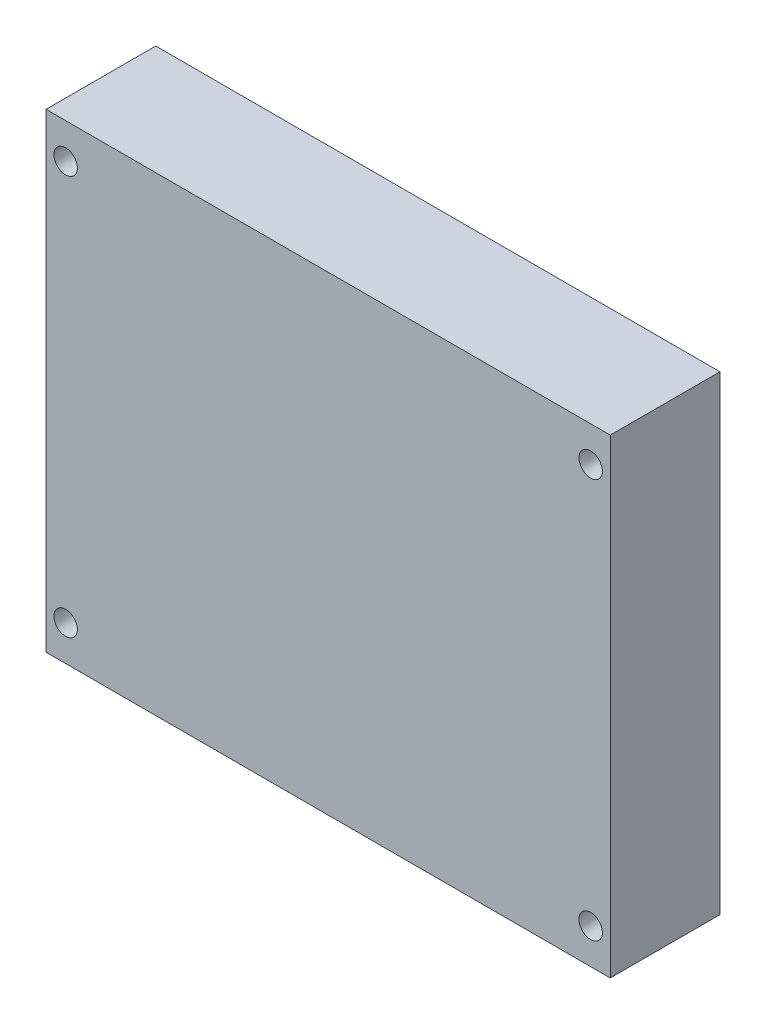
ISO-10303-21;
HEADER;
FILE_DESCRIPTION(('STEP AP214'),'2;1');
FILE_NAME('part.step','',(''),(''),'','','');
FILE_SCHEMA(('AUTOMOTIVE_DESIGN { 1 0 10303 214 1 1 1 1 }'));
ENDSEC;
DATA;
#1=APPLICATION_CONTEXT('core data for automotive mechanical design processes');
#2=APPLICATION_PROTOCOL_DEFINITION('international standard','automotive_design',2000,#1);
#3=PRODUCT_CONTEXT('',#1,'mechanical');
#4=PRODUCT('Part','Part','',(#3));
#5=PRODUCT_RELATED_PRODUCT_CATEGORY('part','',(#4));
#6=PRODUCT_DEFINITION_FORMATION('','',#4);
#7=PRODUCT_DEFINITION_CONTEXT('part definition',#1,'design');
#8=PRODUCT_DEFINITION('design','',#6,#7);
#9=PRODUCT_DEFINITION_SHAPE('','',#8);
#10=(LENGTH_UNIT() NAMED_UNIT(*) SI_UNIT(.MILLI.,.METRE.));
#11=(NAMED_UNIT(*) PLANE_ANGLE_UNIT() SI_UNIT($,.RADIAN.));
#12=(NAMED_UNIT(*) SI_UNIT($,.STERADIAN.) SOLID_ANGLE_UNIT());
#13=UNCERTAINTY_MEASURE_WITH_UNIT(LENGTH_MEASURE(1.E-05),#10,'distance_accuracy_value','');
#14=(GEOMETRIC_REPRESENTATION_CONTEXT(3) GLOBAL_UNCERTAINTY_ASSIGNED_CONTEXT((#13)) GLOBAL_UNIT_ASSIGNED_CONTEXT((#10,
#11,#12)) REPRESENTATION_CONTEXT('',''));
#15=CARTESIAN_POINT('',(0.,0.,0.));
#16=DIRECTION('',(0.,0.,1.));
#17=DIRECTION('',(1.,0.,0.));
#18=AXIS2_PLACEMENT_3D('',#15,#16,#17);
#19=CARTESIAN_POINT('',(0.,0.,14.));
#20=DIRECTION('',(0.,0.,-1.));
#21=DIRECTION('',(-1.,0.,0.));
#22=AXIS2_PLACEMENT_3D('',#19,#20,#21);
#23=PLANE('',#22);
#24=DIRECTION('',(0.,-1.,0.));
#25=VECTOR('',#24,1.);
#26=CARTESIAN_POINT('',(0.,0.,14.));
#27=LINE('',#26,#25);
#28=CARTESIAN_POINT('',(0.,60.,14.));
#29=VERTEX_POINT('',#28);
#30=CARTESIAN_POINT('',(0.,0.,14.));
#31=VERTEX_POINT('',#30);
#32=EDGE_CURVE('E84',#29,#31,#27,.T.);
#33=ORIENTED_EDGE('',*,*,#32,.T.);
#34=DIRECTION('',(1.,0.,0.));
#35=VECTOR('',#34,1.);
#36=CARTESIAN_POINT('',(0.,0.,14.));
#37=LINE('',#36,#35);
#38=CARTESIAN_POINT('',(72.,0.,14.));
#39=VERTEX_POINT('',#38);
#40=EDGE_CURVE('E79',#31,#39,#37,.T.);
#41=ORIENTED_EDGE('',*,*,#40,.T.);
#42=DIRECTION('',(0.,1.,0.));
#43=VECTOR('',#42,1.);
#44=CARTESIAN_POINT('',(72.,0.,14.));
#45=LINE('',#44,#43);
#46=CARTESIAN_POINT('',(72.,60.,14.));
#47=VERTEX_POINT('',#46);
#48=EDGE_CURVE('E82',#39,#47,#45,.T.);
#49=ORIENTED_EDGE('',*,*,#48,.T.);
#50=DIRECTION('',(-1.,0.,0.));
#51=VECTOR('',#50,1.);
#52=CARTESIAN_POINT('',(0.,60.,14.));
#53=LINE('',#52,#51);
#54=EDGE_CURVE('E49',#47,#29,#53,.T.);
#55=ORIENTED_EDGE('',*,*,#54,.T.);
#56=EDGE_LOOP('',(#33,#41,#49,#55));
#57=FACE_BOUND('',#56,.T.);
#58=CARTESIAN_POINT('',(2.5,55.5,14.));
#59=DIRECTION('',(0.,0.,1.));
#60=DIRECTION('',(1.,0.,0.));
#61=AXIS2_PLACEMENT_3D('',#58,#59,#60);
#62=CIRCLE('',#61,1.5);
#63=CARTESIAN_POINT('',(4.,55.5,14.));
#64=VERTEX_POINT('',#63);
#65=EDGE_CURVE('E99',#64,#64,#62,.T.);
#66=ORIENTED_EDGE('',*,*,#65,.F.);
#67=EDGE_LOOP('',(#66));
#68=FACE_BOUND('',#67,.T.);
#69=CARTESIAN_POINT('',(69.5,55.5,14.));
#70=DIRECTION('',(0.,0.,1.));
#71=DIRECTION('',(1.,0.,0.));
#72=AXIS2_PLACEMENT_3D('',#69,#70,#71);
#73=CIRCLE('',#72,1.5);
#74=CARTESIAN_POINT('',(71.,55.5,14.));
#75=VERTEX_POINT('',#74);
#76=EDGE_CURVE('E114',#75,#75,#73,.T.);
#77=ORIENTED_EDGE('',*,*,#76,.F.);
#78=EDGE_LOOP('',(#77));
#79=FACE_BOUND('',#78,.T.);
#80=CARTESIAN_POINT('',(69.5,4.5,14.));
#81=DIRECTION('',(0.,0.,1.));
#82=DIRECTION('',(1.,0.,0.));
#83=AXIS2_PLACEMENT_3D('',#80,#81,#82);
#84=CIRCLE('',#83,1.5);
#85=CARTESIAN_POINT('',(71.,4.5,14.));
#86=VERTEX_POINT('',#85);
#87=EDGE_CURVE('E120',#86,#86,#84,.T.);
#88=ORIENTED_EDGE('',*,*,#87,.F.);
#89=EDGE_LOOP('',(#88));
#90=FACE_BOUND('',#89,.T.);
#91=CARTESIAN_POINT('',(2.50000000000001,4.5,14.));
#92=DIRECTION('',(0.,0.,1.));
#93=DIRECTION('',(1.,0.,0.));
#94=AXIS2_PLACEMENT_3D('',#91,#92,#93);
#95=CIRCLE('',#94,1.5);
#96=CARTESIAN_POINT('',(4.00000000000001,4.5,14.));
#97=VERTEX_POINT('',#96);
#98=EDGE_CURVE('E126',#97,#97,#95,.T.);
#99=ORIENTED_EDGE('',*,*,#98,.F.);
#100=EDGE_LOOP('',(#99));
#101=FACE_BOUND('',#100,.T.);
#102=ADVANCED_FACE('F32',(#57,#68,#79,#90,#101),#23,.F.);
#103=CARTESIAN_POINT('',(0.,0.,0.));
#104=DIRECTION('',(0.,0.,-1.));
#105=DIRECTION('',(-1.,0.,0.));
#106=AXIS2_PLACEMENT_3D('',#103,#104,#105);
#107=PLANE('',#106);
#108=CARTESIAN_POINT('',(69.5,4.5,0.));
#109=DIRECTION('',(0.,0.,1.));
#110=DIRECTION('',(1.,0.,0.));
#111=AXIS2_PLACEMENT_3D('',#108,#109,#110);
#112=CIRCLE('',#111,1.5);
#113=CARTESIAN_POINT('',(71.,4.5,0.));
#114=VERTEX_POINT('',#113);
#115=EDGE_CURVE('E123',#114,#114,#112,.T.);
#116=ORIENTED_EDGE('',*,*,#115,.T.);
#117=EDGE_LOOP('',(#116));
#118=FACE_BOUND('',#117,.T.);
#119=CARTESIAN_POINT('',(2.5,55.5,0.));
#120=DIRECTION('',(0.,0.,1.));
#121=DIRECTION('',(1.,0.,0.));
#122=AXIS2_PLACEMENT_3D('',#119,#120,#121);
#123=CIRCLE('',#122,1.5);
#124=CARTESIAN_POINT('',(4.,55.5,0.));
#125=VERTEX_POINT('',#124);
#126=EDGE_CURVE('E111',#125,#125,#123,.T.);
#127=ORIENTED_EDGE('',*,*,#126,.T.);
#128=EDGE_LOOP('',(#127));
#129=FACE_BOUND('',#128,.T.);
#130=DIRECTION('',(0.,-1.,0.));
#131=VECTOR('',#130,1.);
#132=CARTESIAN_POINT('',(0.,0.,0.));
#133=LINE('',#132,#131);
#134=CARTESIAN_POINT('',(0.,60.,0.));
#135=VERTEX_POINT('',#134);
#136=CARTESIAN_POINT('',(0.,0.,0.));
#137=VERTEX_POINT('',#136);
#138=EDGE_CURVE('E96',#135,#137,#133,.T.);
#139=ORIENTED_EDGE('',*,*,#138,.F.);
#140=DIRECTION('',(-1.,0.,0.));
#141=VECTOR('',#140,1.);
#142=CARTESIAN_POINT('',(0.,60.,0.));
#143=LINE('',#142,#141);
#144=CARTESIAN_POINT('',(72.,60.,0.));
#145=VERTEX_POINT('',#144);
#146=EDGE_CURVE('E72',#145,#135,#143,.T.);
#147=ORIENTED_EDGE('',*,*,#146,.F.);
#148=DIRECTION('',(0.,1.,0.));
#149=VECTOR('',#148,1.);
#150=CARTESIAN_POINT('',(72.,0.,0.));
#151=LINE('',#150,#149);
#152=CARTESIAN_POINT('',(72.,0.,0.));
#153=VERTEX_POINT('',#152);
#154=EDGE_CURVE('E66',#153,#145,#151,.T.);
#155=ORIENTED_EDGE('',*,*,#154,.F.);
#156=DIRECTION('',(1.,0.,0.));
#157=VECTOR('',#156,1.);
#158=CARTESIAN_POINT('',(0.,0.,0.));
#159=LINE('',#158,#157);
#160=EDGE_CURVE('E88',#137,#153,#159,.T.);
#161=ORIENTED_EDGE('',*,*,#160,.F.);
#162=EDGE_LOOP('',(#139,#147,#155,#161));
#163=FACE_BOUND('',#162,.T.);
#164=CARTESIAN_POINT('',(69.5,55.5,0.));
#165=DIRECTION('',(0.,0.,1.));
#166=DIRECTION('',(1.,0.,0.));
#167=AXIS2_PLACEMENT_3D('',#164,#165,#166);
#168=CIRCLE('',#167,1.5);
#169=CARTESIAN_POINT('',(71.,55.5,0.));
#170=VERTEX_POINT('',#169);
#171=EDGE_CURVE('E117',#170,#170,#168,.T.);
#172=ORIENTED_EDGE('',*,*,#171,.T.);
#173=EDGE_LOOP('',(#172));
#174=FACE_BOUND('',#173,.T.);
#175=CARTESIAN_POINT('',(2.50000000000001,4.5,0.));
#176=DIRECTION('',(0.,0.,1.));
#177=DIRECTION('',(1.,0.,0.));
#178=AXIS2_PLACEMENT_3D('',#175,#176,#177);
#179=CIRCLE('',#178,1.5);
#180=CARTESIAN_POINT('',(4.00000000000001,4.5,0.));
#181=VERTEX_POINT('',#180);
#182=EDGE_CURVE('E129',#181,#181,#179,.T.);
#183=ORIENTED_EDGE('',*,*,#182,.T.);
#184=EDGE_LOOP('',(#183));
#185=FACE_BOUND('',#184,.T.);
#186=ADVANCED_FACE('F107',(#118,#129,#163,#174,#185),#107,.T.);
#187=CARTESIAN_POINT('',(0.,0.,14.));
#188=DIRECTION('',(1.,0.,0.));
#189=DIRECTION('',(0.,0.,-1.));
#190=AXIS2_PLACEMENT_3D('',#187,#188,#189);
#191=PLANE('',#190);
#192=ORIENTED_EDGE('',*,*,#138,.T.);
#193=DIRECTION('',(0.,0.,-1.));
#194=VECTOR('',#193,1.);
#195=CARTESIAN_POINT('',(0.,0.,14.));
#196=LINE('',#195,#194);
#197=EDGE_CURVE('E11',#31,#137,#196,.T.);
#198=ORIENTED_EDGE('',*,*,#197,.F.);
#199=ORIENTED_EDGE('',*,*,#32,.F.);
#200=DIRECTION('',(0.,0.,-1.));
#201=VECTOR('',#200,1.);
#202=CARTESIAN_POINT('',(0.,60.,14.));
#203=LINE('',#202,#201);
#204=EDGE_CURVE('E92',#29,#135,#203,.T.);
#205=ORIENTED_EDGE('',*,*,#204,.T.);
#206=EDGE_LOOP('',(#192,#198,#199,#205));
#207=FACE_BOUND('',#206,.T.);
#208=ADVANCED_FACE('F34',(#207),#191,.F.);
#209=CARTESIAN_POINT('',(0.,0.,14.));
#210=DIRECTION('',(0.,1.,0.));
#211=DIRECTION('',(0.,0.,1.));
#212=AXIS2_PLACEMENT_3D('',#209,#210,#211);
#213=PLANE('',#212);
#214=ORIENTED_EDGE('',*,*,#160,.T.);
#215=DIRECTION('',(0.,0.,-1.));
#216=VECTOR('',#215,1.);
#217=CARTESIAN_POINT('',(72.,0.,14.));
#218=LINE('',#217,#216);
#219=EDGE_CURVE('E41',#39,#153,#218,.T.);
#220=ORIENTED_EDGE('',*,*,#219,.F.);
#221=ORIENTED_EDGE('',*,*,#40,.F.);
#222=ORIENTED_EDGE('',*,*,#197,.T.);
#223=EDGE_LOOP('',(#214,#220,#221,#222));
#224=FACE_BOUND('',#223,.T.);
#225=ADVANCED_FACE('F87',(#224),#213,.F.);
#226=CARTESIAN_POINT('',(72.,0.,14.));
#227=DIRECTION('',(-1.,0.,0.));
#228=DIRECTION('',(0.,-1.,0.));
#229=AXIS2_PLACEMENT_3D('',#226,#227,#228);
#230=PLANE('',#229);
#231=ORIENTED_EDGE('',*,*,#154,.T.);
#232=DIRECTION('',(0.,0.,-1.));
#233=VECTOR('',#232,1.);
#234=CARTESIAN_POINT('',(72.,60.,14.));
#235=LINE('',#234,#233);
#236=EDGE_CURVE('E89',#47,#145,#235,.T.);
#237=ORIENTED_EDGE('',*,*,#236,.F.);
#238=ORIENTED_EDGE('',*,*,#48,.F.);
#239=ORIENTED_EDGE('',*,*,#219,.T.);
#240=EDGE_LOOP('',(#231,#237,#238,#239));
#241=FACE_BOUND('',#240,.T.);
#242=ADVANCED_FACE('F90',(#241),#230,.F.);
#243=CARTESIAN_POINT('',(0.,60.,14.));
#244=DIRECTION('',(0.,-1.,0.));
#245=DIRECTION('',(0.,0.,-1.));
#246=AXIS2_PLACEMENT_3D('',#243,#244,#245);
#247=PLANE('',#246);
#248=ORIENTED_EDGE('',*,*,#146,.T.);
#249=ORIENTED_EDGE('',*,*,#204,.F.);
#250=ORIENTED_EDGE('',*,*,#54,.F.);
#251=ORIENTED_EDGE('',*,*,#236,.T.);
#252=EDGE_LOOP('',(#248,#249,#250,#251));
#253=FACE_BOUND('',#252,.T.);
#254=ADVANCED_FACE('F104',(#253),#247,.F.);
#255=CARTESIAN_POINT('',(2.5,55.5,14.));
#256=DIRECTION('',(0.,0.,-1.));
#257=DIRECTION('',(-1.,0.,0.));
#258=AXIS2_PLACEMENT_3D('',#255,#256,#257);
#259=CYLINDRICAL_SURFACE('',#258,1.5);
#260=ORIENTED_EDGE('',*,*,#65,.T.);
#261=EDGE_LOOP('',(#260));
#262=FACE_BOUND('',#261,.T.);
#263=ORIENTED_EDGE('',*,*,#126,.F.);
#264=EDGE_LOOP('',(#263));
#265=FACE_BOUND('',#264,.T.);
#266=ADVANCED_FACE('F146',(#262,#265),#259,.F.);
#267=CARTESIAN_POINT('',(69.5,55.5,14.));
#268=DIRECTION('',(0.,0.,-1.));
#269=DIRECTION('',(-1.,0.,0.));
#270=AXIS2_PLACEMENT_3D('',#267,#268,#269);
#271=CYLINDRICAL_SURFACE('',#270,1.5);
#272=ORIENTED_EDGE('',*,*,#76,.T.);
#273=EDGE_LOOP('',(#272));
#274=FACE_BOUND('',#273,.T.);
#275=ORIENTED_EDGE('',*,*,#171,.F.);
#276=EDGE_LOOP('',(#275));
#277=FACE_BOUND('',#276,.T.);
#278=ADVANCED_FACE('F192',(#274,#277),#271,.F.);
#279=CARTESIAN_POINT('',(69.5,4.5,14.));
#280=DIRECTION('',(0.,0.,-1.));
#281=DIRECTION('',(-1.,0.,0.));
#282=AXIS2_PLACEMENT_3D('',#279,#280,#281);
#283=CYLINDRICAL_SURFACE('',#282,1.5);
#284=ORIENTED_EDGE('',*,*,#87,.T.);
#285=EDGE_LOOP('',(#284));
#286=FACE_BOUND('',#285,.T.);
#287=ORIENTED_EDGE('',*,*,#115,.F.);
#288=EDGE_LOOP('',(#287));
#289=FACE_BOUND('',#288,.T.);
#290=ADVANCED_FACE('F200',(#286,#289),#283,.F.);
#291=CARTESIAN_POINT('',(2.50000000000001,4.5,14.));
#292=DIRECTION('',(0.,0.,-1.));
#293=DIRECTION('',(-1.,0.,0.));
#294=AXIS2_PLACEMENT_3D('',#291,#292,#293);
#295=CYLINDRICAL_SURFACE('',#294,1.5);
#296=ORIENTED_EDGE('',*,*,#98,.T.);
#297=EDGE_LOOP('',(#296));
#298=FACE_BOUND('',#297,.T.);
#299=ORIENTED_EDGE('',*,*,#182,.F.);
#300=EDGE_LOOP('',(#299));
#301=FACE_BOUND('',#300,.T.);
#302=ADVANCED_FACE('F135',(#298,#301),#295,.F.);
#303=CLOSED_SHELL('',(#102,#186,#208,#225,#242,#254,#266,#278,#290,#302));
#304=MANIFOLD_SOLID_BREP('B2',#303);
#305=ADVANCED_BREP_SHAPE_REPRESENTATION('',(#18,#304),#14);
#306=SHAPE_DEFINITION_REPRESENTATION(#9,#305);
ENDSEC;
END-ISO-10303-21;
